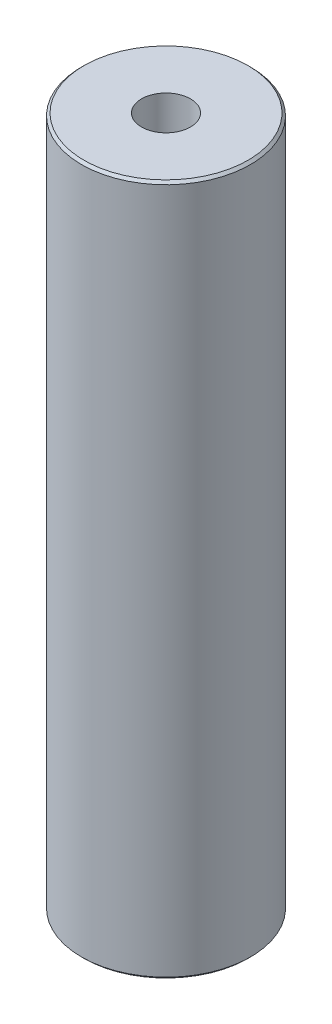
ISO-10303-21;
HEADER;
FILE_DESCRIPTION(('STEP AP214'),'2;1');
FILE_NAME('part.step','',(''),(''),'','','');
FILE_SCHEMA(('AUTOMOTIVE_DESIGN { 1 0 10303 214 1 1 1 1 }'));
ENDSEC;
DATA;
#1=APPLICATION_CONTEXT('core data for automotive mechanical design processes');
#2=APPLICATION_PROTOCOL_DEFINITION('international standard','automotive_design',2000,#1);
#3=PRODUCT_CONTEXT('',#1,'mechanical');
#4=PRODUCT('Part','Part','',(#3));
#5=PRODUCT_RELATED_PRODUCT_CATEGORY('part','',(#4));
#6=PRODUCT_DEFINITION_FORMATION('','',#4);
#7=PRODUCT_DEFINITION_CONTEXT('part definition',#1,'design');
#8=PRODUCT_DEFINITION('design','',#6,#7);
#9=PRODUCT_DEFINITION_SHAPE('','',#8);
#10=(LENGTH_UNIT() NAMED_UNIT(*) SI_UNIT(.MILLI.,.METRE.));
#11=(NAMED_UNIT(*) PLANE_ANGLE_UNIT() SI_UNIT($,.RADIAN.));
#12=(NAMED_UNIT(*) SI_UNIT($,.STERADIAN.) SOLID_ANGLE_UNIT());
#13=UNCERTAINTY_MEASURE_WITH_UNIT(LENGTH_MEASURE(1.E-05),#10,'distance_accuracy_value','');
#14=(GEOMETRIC_REPRESENTATION_CONTEXT(3) GLOBAL_UNCERTAINTY_ASSIGNED_CONTEXT((#13)) GLOBAL_UNIT_ASSIGNED_CONTEXT((#10,
#11,#12)) REPRESENTATION_CONTEXT('',''));
#15=CARTESIAN_POINT('',(0.,0.,0.));
#16=DIRECTION('',(0.,0.,1.));
#17=DIRECTION('',(1.,0.,0.));
#18=AXIS2_PLACEMENT_3D('',#15,#16,#17);
#19=CARTESIAN_POINT('',(0.,224.896192392195,0.));
#20=DIRECTION('',(0.,-1.,0.));
#21=DIRECTION('',(0.,0.,-1.));
#22=AXIS2_PLACEMENT_3D('',#19,#20,#21);
#23=CYLINDRICAL_SURFACE('',#22,27.5);
#24=CARTESIAN_POINT('',(0.,224.088787110902,0.));
#25=DIRECTION('',(0.,1.,0.));
#26=DIRECTION('',(0.,0.,1.));
#27=AXIS2_PLACEMENT_3D('',#24,#25,#26);
#28=CIRCLE('',#27,27.5);
#29=CARTESIAN_POINT('',(0.,224.088787110902,-27.5));
#30=VERTEX_POINT('',#29);
#31=EDGE_CURVE('E50',#30,#30,#28,.F.);
#32=ORIENTED_EDGE('',*,*,#31,.T.);
#33=EDGE_LOOP('',(#32));
#34=FACE_BOUND('',#33,.T.);
#35=CARTESIAN_POINT('',(0.,0.807405281293111,0.));
#36=DIRECTION('',(0.,1.,0.));
#37=DIRECTION('',(0.,0.,1.));
#38=AXIS2_PLACEMENT_3D('',#35,#36,#37);
#39=CIRCLE('',#38,27.5);
#40=CARTESIAN_POINT('',(0.,0.807405281293111,27.5));
#41=VERTEX_POINT('',#40);
#42=EDGE_CURVE('E51',#41,#41,#39,.T.);
#43=ORIENTED_EDGE('',*,*,#42,.T.);
#44=EDGE_LOOP('',(#43));
#45=FACE_BOUND('',#44,.T.);
#46=ADVANCED_FACE('F39',(#34,#45),#23,.T.);
#47=CARTESIAN_POINT('',(0.,224.896192392195,0.));
#48=DIRECTION('',(0.,1.,0.));
#49=DIRECTION('',(0.,0.,1.));
#50=AXIS2_PLACEMENT_3D('',#47,#48,#49);
#51=PLANE('',#50);
#52=CARTESIAN_POINT('',(0.,224.896192392195,0.));
#53=DIRECTION('',(0.,1.,0.));
#54=DIRECTION('',(0.,0.,1.));
#55=AXIS2_PLACEMENT_3D('',#52,#53,#54);
#56=CIRCLE('',#55,26.6925947187069);
#57=CARTESIAN_POINT('',(0.,224.896192392195,-26.692594718707));
#58=VERTEX_POINT('',#57);
#59=EDGE_CURVE('E54',#58,#58,#56,.T.);
#60=ORIENTED_EDGE('',*,*,#59,.T.);
#61=EDGE_LOOP('',(#60));
#62=FACE_BOUND('',#61,.T.);
#63=CARTESIAN_POINT('',(0.,224.896192392195,0.));
#64=DIRECTION('',(0.,1.,0.));
#65=DIRECTION('',(0.,0.,1.));
#66=AXIS2_PLACEMENT_3D('',#63,#64,#65);
#67=CIRCLE('',#66,7.95719337445772);
#68=CARTESIAN_POINT('',(0.,224.896192392195,7.95719337445772));
#69=VERTEX_POINT('',#68);
#70=EDGE_CURVE('E58',#69,#69,#67,.T.);
#71=ORIENTED_EDGE('',*,*,#70,.F.);
#72=EDGE_LOOP('',(#71));
#73=FACE_BOUND('',#72,.T.);
#74=ADVANCED_FACE('F69',(#62,#73),#51,.T.);
#75=CARTESIAN_POINT('',(0.,0.,0.));
#76=DIRECTION('',(0.,1.,0.));
#77=DIRECTION('',(0.,0.,1.));
#78=AXIS2_PLACEMENT_3D('',#75,#76,#77);
#79=PLANE('',#78);
#80=CARTESIAN_POINT('',(0.,0.,0.));
#81=DIRECTION('',(0.,1.,0.));
#82=DIRECTION('',(0.,0.,1.));
#83=AXIS2_PLACEMENT_3D('',#80,#81,#82);
#84=CIRCLE('',#83,26.6925947187069);
#85=CARTESIAN_POINT('',(0.,0.,26.6925947187069));
#86=VERTEX_POINT('',#85);
#87=EDGE_CURVE('E10',#86,#86,#84,.F.);
#88=ORIENTED_EDGE('',*,*,#87,.T.);
#89=EDGE_LOOP('',(#88));
#90=FACE_BOUND('',#89,.T.);
#91=CARTESIAN_POINT('',(0.,0.,0.));
#92=DIRECTION('',(0.,1.,0.));
#93=DIRECTION('',(0.,0.,1.));
#94=AXIS2_PLACEMENT_3D('',#91,#92,#93);
#95=CIRCLE('',#94,7.95719337445772);
#96=CARTESIAN_POINT('',(0.,0.,7.95719337445772));
#97=VERTEX_POINT('',#96);
#98=EDGE_CURVE('E63',#97,#97,#95,.T.);
#99=ORIENTED_EDGE('',*,*,#98,.T.);
#100=EDGE_LOOP('',(#99));
#101=FACE_BOUND('',#100,.T.);
#102=ADVANCED_FACE('F75',(#90,#101),#79,.F.);
#103=CARTESIAN_POINT('',(0.,224.896192392195,0.));
#104=DIRECTION('',(0.,-1.,0.));
#105=DIRECTION('',(0.,0.,-1.));
#106=AXIS2_PLACEMENT_3D('',#103,#104,#105);
#107=CYLINDRICAL_SURFACE('',#106,7.95719337445772);
#108=ORIENTED_EDGE('',*,*,#70,.T.);
#109=EDGE_LOOP('',(#108));
#110=FACE_BOUND('',#109,.T.);
#111=ORIENTED_EDGE('',*,*,#98,.F.);
#112=EDGE_LOOP('',(#111));
#113=FACE_BOUND('',#112,.T.);
#114=ADVANCED_FACE('F70',(#110,#113),#107,.F.);
#115=CARTESIAN_POINT('',(0.,224.896192392195,0.));
#116=DIRECTION('',(0.,-1.,0.));
#117=DIRECTION('',(0.,0.,-1.));
#118=AXIS2_PLACEMENT_3D('',#115,#116,#117);
#119=CONICAL_SURFACE('',#118,26.6925947187069,0.785398163397435);
#120=CARTESIAN_POINT('',(0.,224.088787110902,-27.5));
#121=CARTESIAN_POINT('',(0.,224.097197582582,-27.4915895283199));
#122=CARTESIAN_POINT('',(0.,224.105608054262,-27.4831790566397));
#123=CARTESIAN_POINT('',(0.,224.122428997623,-27.4663581132795));
#124=CARTESIAN_POINT('',(0.,224.130839469303,-27.4579476415993));
#125=CARTESIAN_POINT('',(0.,224.147660412663,-27.4411266982391));
#126=CARTESIAN_POINT('',(0.,224.156070884343,-27.4327162265589));
#127=CARTESIAN_POINT('',(0.,224.172891827704,-27.4158952831987));
#128=CARTESIAN_POINT('',(0.,224.181302299384,-27.4074848115185));
#129=CARTESIAN_POINT('',(0.,224.198123242744,-27.3906638681582));
#130=CARTESIAN_POINT('',(0.,224.206533714424,-27.3822533964781));
#131=CARTESIAN_POINT('',(0.,224.223354657784,-27.3654324531178));
#132=CARTESIAN_POINT('',(0.,224.231765129464,-27.3570219814377));
#133=CARTESIAN_POINT('',(0.,224.248586072825,-27.3402010380774));
#134=CARTESIAN_POINT('',(0.,224.256996544505,-27.3317905663973));
#135=CARTESIAN_POINT('',(0.,224.273817487865,-27.314969623037));
#136=CARTESIAN_POINT('',(0.,224.282227959545,-27.3065591513569));
#137=CARTESIAN_POINT('',(0.,224.299048902906,-27.2897382079966));
#138=CARTESIAN_POINT('',(0.,224.307459374586,-27.2813277363165));
#139=CARTESIAN_POINT('',(0.,224.324280317946,-27.2645067929562));
#140=CARTESIAN_POINT('',(0.,224.332690789626,-27.2560963212761));
#141=CARTESIAN_POINT('',(0.,224.349511732986,-27.2392753779158));
#142=CARTESIAN_POINT('',(0.,224.357922204667,-27.2308649062357));
#143=CARTESIAN_POINT('',(0.,224.374743148027,-27.2140439628754));
#144=CARTESIAN_POINT('',(0.,224.383153619707,-27.2056334911953));
#145=CARTESIAN_POINT('',(0.,224.399974563067,-27.188812547835));
#146=CARTESIAN_POINT('',(0.,224.408385034747,-27.1804020761548));
#147=CARTESIAN_POINT('',(0.,224.425205978108,-27.1635811327946));
#148=CARTESIAN_POINT('',(0.,224.433616449788,-27.1551706611144));
#149=CARTESIAN_POINT('',(0.,224.450437393148,-27.1383497177542));
#150=CARTESIAN_POINT('',(0.,224.458847864828,-27.129939246074));
#151=CARTESIAN_POINT('',(0.,224.475668808188,-27.1131183027138));
#152=CARTESIAN_POINT('',(0.,224.484079279869,-27.1047078310336));
#153=CARTESIAN_POINT('',(0.,224.500900223229,-27.0878868876733));
#154=CARTESIAN_POINT('',(0.,224.509310694909,-27.0794764159932));
#155=CARTESIAN_POINT('',(0.,224.526131638269,-27.0626554726329));
#156=CARTESIAN_POINT('',(0.,224.534542109949,-27.0542450009528));
#157=CARTESIAN_POINT('',(0.,224.55136305331,-27.0374240575925));
#158=CARTESIAN_POINT('',(0.,224.55977352499,-27.0290135859124));
#159=CARTESIAN_POINT('',(0.,224.57659446835,-27.0121926425521));
#160=CARTESIAN_POINT('',(0.,224.58500494003,-27.003782170872));
#161=CARTESIAN_POINT('',(0.,224.60182588339,-26.9869612275117));
#162=CARTESIAN_POINT('',(0.,224.610236355071,-26.9785507558316));
#163=CARTESIAN_POINT('',(0.,224.627057298431,-26.9617298124713));
#164=CARTESIAN_POINT('',(0.,224.635467770111,-26.9533193407912));
#165=CARTESIAN_POINT('',(0.,224.652288713471,-26.9364983974309));
#166=CARTESIAN_POINT('',(0.,224.660699185151,-26.9280879257508));
#167=CARTESIAN_POINT('',(0.,224.677520128512,-26.9112669823905));
#168=CARTESIAN_POINT('',(0.,224.685930600192,-26.9028565107104));
#169=CARTESIAN_POINT('',(0.,224.702751543552,-26.8860355673501));
#170=CARTESIAN_POINT('',(0.,224.711162015232,-26.8776250956699));
#171=CARTESIAN_POINT('',(0.,224.727982958593,-26.8608041523097));
#172=CARTESIAN_POINT('',(0.,224.736393430273,-26.8523936806295));
#173=CARTESIAN_POINT('',(0.,224.753214373633,-26.8355727372693));
#174=CARTESIAN_POINT('',(0.,224.761624845313,-26.8271622655891));
#175=CARTESIAN_POINT('',(0.,224.778445788673,-26.8103413222289));
#176=CARTESIAN_POINT('',(0.,224.786856260353,-26.8019308505487));
#177=CARTESIAN_POINT('',(0.,224.803677203714,-26.7851099071884));
#178=CARTESIAN_POINT('',(0.,224.812087675394,-26.7766994355083));
#179=CARTESIAN_POINT('',(0.,224.828908618754,-26.759878492148));
#180=CARTESIAN_POINT('',(0.,224.837319090434,-26.7514680204679));
#181=CARTESIAN_POINT('',(0.,224.854140033795,-26.7346470771076));
#182=CARTESIAN_POINT('',(0.,224.862550505475,-26.7262366054275));
#183=CARTESIAN_POINT('',(0.,224.879371448835,-26.7094156620672));
#184=CARTESIAN_POINT('',(0.,224.887781920515,-26.7010051903871));
#185=CARTESIAN_POINT('',(0.,224.896192392195,-26.692594718707));
#186=B_SPLINE_CURVE_WITH_KNOTS('',3,(#120,#121,#122,#123,#124,#125,#126,#127,#128,#129,#130,
#131,#132,#133,#134,#135,#136,#137,#138,#139,#140,#141,#142,#143,#144,#145,#146,#147,#148,#149,
#150,#151,#152,#153,#154,#155,#156,#157,#158,#159,#160,#161,#162,#163,#164,#165,#166,#167,#168,
#169,#170,#171,#172,#173,#174,#175,#176,#177,#178,#179,#180,#181,#182,#183,#184,#185),
.UNSPECIFIED.,.F.,.F.,(4,2,2,2,2,2,2,2,2,2,2,2,2,2,2,2,2,2,2,2,2,2,2,2,2,2,2,2,2,2,2,2,4),(0.,
0.0356826093480279,0.0713652186960361,0.107047828044042,0.14273043739205,0.178413046740058,
0.214095656088067,0.249778265436075,0.285460874784081,0.321143484132109,0.356826093480117,
0.392508702828125,0.428191312176133,0.463873921524141,0.499556530872147,0.535239140220155,
0.570921749568164,0.606604358916192,0.6422869682642,0.677969577612206,0.713652186960214,
0.749334796308222,0.78501740565623,0.820700015004239,0.856382624352266,0.892065233700272,
0.92774784304828,0.963430452396289,0.999113061744297,1.0347956710923,1.07047828044031,
1.10616088978832,1.14184349913635),.UNSPECIFIED.);
#187=EDGE_CURVE('BSEAM81',#30,#58,#186,.T.);
#188=ORIENTED_EDGE('',*,*,#31,.F.);
#189=ORIENTED_EDGE('',*,*,#59,.F.);
#190=ORIENTED_EDGE('',*,*,#187,.T.);
#191=ORIENTED_EDGE('',*,*,#187,.F.);
#192=EDGE_LOOP('',(#188,#190,#189,#191));
#193=FACE_BOUND('',#192,.T.);
#194=ADVANCED_FACE('F81',(#193),#119,.T.);
#195=CARTESIAN_POINT('',(0.,0.807405281293111,0.));
#196=DIRECTION('',(0.,1.,0.));
#197=DIRECTION('',(0.,0.,1.));
#198=AXIS2_PLACEMENT_3D('',#195,#196,#197);
#199=CONICAL_SURFACE('',#198,27.5,0.785398163397453);
#200=ORIENTED_EDGE('',*,*,#87,.F.);
#201=EDGE_LOOP('',(#200));
#202=FACE_BOUND('',#201,.T.);
#203=ORIENTED_EDGE('',*,*,#42,.F.);
#204=EDGE_LOOP('',(#203));
#205=FACE_BOUND('',#204,.T.);
#206=ADVANCED_FACE('F45',(#202,#205),#199,.T.);
#207=CLOSED_SHELL('',(#46,#74,#102,#114,#194,#206));
#208=MANIFOLD_SOLID_BREP('B2',#207);
#209=ADVANCED_BREP_SHAPE_REPRESENTATION('',(#18,#208),#14);
#210=SHAPE_DEFINITION_REPRESENTATION(#9,#209);
ENDSEC;
END-ISO-10303-21;
